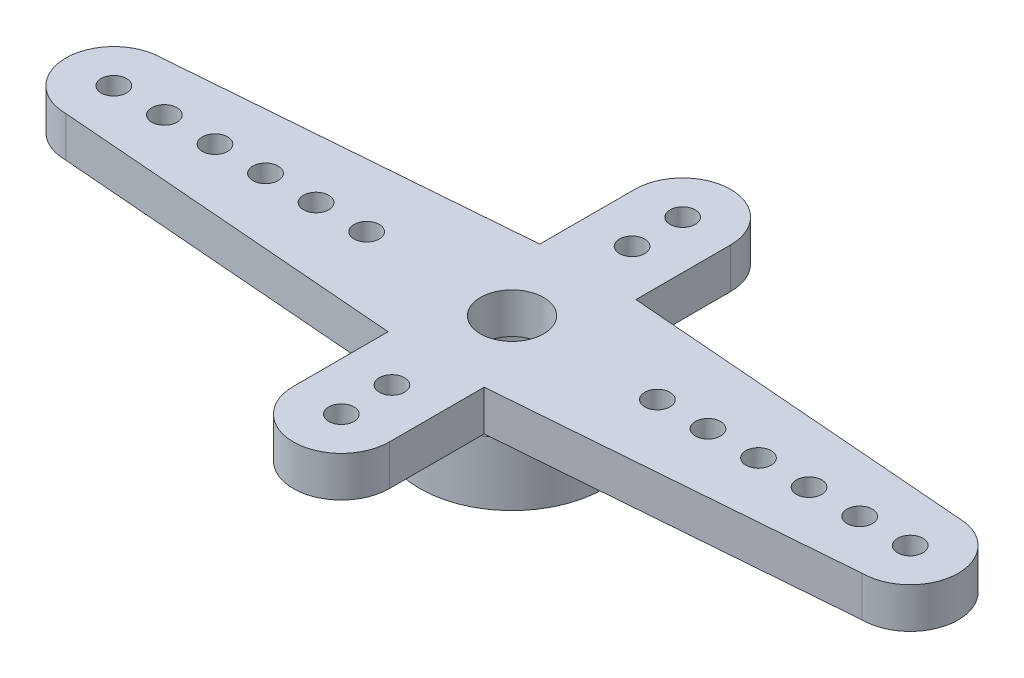
ISO-10303-21;
HEADER;
FILE_DESCRIPTION(('STEP AP214'),'2;1');
FILE_NAME('part.step','',(''),(''),'','','');
FILE_SCHEMA(('AUTOMOTIVE_DESIGN { 1 0 10303 214 1 1 1 1 }'));
ENDSEC;
DATA;
#1=APPLICATION_CONTEXT('core data for automotive mechanical design processes');
#2=APPLICATION_PROTOCOL_DEFINITION('international standard','automotive_design',2000,#1);
#3=PRODUCT_CONTEXT('',#1,'mechanical');
#4=PRODUCT('Part','Part','',(#3));
#5=PRODUCT_RELATED_PRODUCT_CATEGORY('part','',(#4));
#6=PRODUCT_DEFINITION_FORMATION('','',#4);
#7=PRODUCT_DEFINITION_CONTEXT('part definition',#1,'design');
#8=PRODUCT_DEFINITION('design','',#6,#7);
#9=PRODUCT_DEFINITION_SHAPE('','',#8);
#10=(LENGTH_UNIT() NAMED_UNIT(*) SI_UNIT(.MILLI.,.METRE.));
#11=(NAMED_UNIT(*) PLANE_ANGLE_UNIT() SI_UNIT($,.RADIAN.));
#12=(NAMED_UNIT(*) SI_UNIT($,.STERADIAN.) SOLID_ANGLE_UNIT());
#13=UNCERTAINTY_MEASURE_WITH_UNIT(LENGTH_MEASURE(1.E-05),#10,'distance_accuracy_value','');
#14=(GEOMETRIC_REPRESENTATION_CONTEXT(3) GLOBAL_UNCERTAINTY_ASSIGNED_CONTEXT((#13)) GLOBAL_UNIT_ASSIGNED_CONTEXT((#10,
#11,#12)) REPRESENTATION_CONTEXT('',''));
#15=CARTESIAN_POINT('',(0.,0.,0.));
#16=DIRECTION('',(0.,0.,1.));
#17=DIRECTION('',(1.,0.,0.));
#18=AXIS2_PLACEMENT_3D('',#15,#16,#17);
#19=CARTESIAN_POINT('',(0.,2.5,0.));
#20=DIRECTION('',(0.,1.,0.));
#21=DIRECTION('',(0.,0.,1.));
#22=AXIS2_PLACEMENT_3D('',#19,#20,#21);
#23=PLANE('',#22);
#24=DIRECTION('',(0.,0.,-1.));
#25=VECTOR('',#24,1.);
#26=CARTESIAN_POINT('',(1.9,2.5,-6.75));
#27=LINE('',#26,#25);
#28=CARTESIAN_POINT('',(1.9,2.5,-3.));
#29=VERTEX_POINT('',#28);
#30=CARTESIAN_POINT('',(1.9,2.5,-3.11648840844948));
#31=VERTEX_POINT('',#30);
#32=EDGE_CURVE('E51',#29,#31,#27,.T.);
#33=ORIENTED_EDGE('',*,*,#32,.F.);
#34=DIRECTION('',(-0.996860885732547,0.,-0.0791730667368807));
#35=VECTOR('',#34,1.);
#36=CARTESIAN_POINT('',(15.75,2.5,-1.9));
#37=LINE('',#36,#35);
#38=CARTESIAN_POINT('',(2.10202641784576,2.5,-2.9839545805321));
#39=VERTEX_POINT('',#38);
#40=EDGE_CURVE('E11',#39,#29,#37,.T.);
#41=ORIENTED_EDGE('',*,*,#40,.F.);
#42=CARTESIAN_POINT('',(0.,2.5,0.));
#43=DIRECTION('',(0.,1.,0.));
#44=DIRECTION('',(0.,0.,1.));
#45=AXIS2_PLACEMENT_3D('',#42,#43,#44);
#46=CIRCLE('',#45,3.65);
#47=EDGE_CURVE('E197',#39,#31,#46,.T.);
#48=ORIENTED_EDGE('',*,*,#47,.T.);
#49=EDGE_LOOP('',(#33,#41,#48));
#50=FACE_BOUND('',#49,.T.);
#51=ADVANCED_FACE('F33',(#50),#23,.T.);
#52=DIRECTION('',(0.996860885732547,0.,-0.0791730667368813));
#53=VECTOR('',#52,1.);
#54=CARTESIAN_POINT('',(15.75,2.5,1.9));
#55=LINE('',#54,#53);
#56=CARTESIAN_POINT('',(1.9,2.5,3.00000000000001));
#57=VERTEX_POINT('',#56);
#58=CARTESIAN_POINT('',(2.10202641784575,2.5,2.98395458053211));
#59=VERTEX_POINT('',#58);
#60=EDGE_CURVE('E58',#57,#59,#55,.T.);
#61=ORIENTED_EDGE('',*,*,#60,.F.);
#62=DIRECTION('',(0.,0.,-1.));
#63=VECTOR('',#62,1.);
#64=CARTESIAN_POINT('',(1.9,2.5,6.75000000000001));
#65=LINE('',#64,#63);
#66=CARTESIAN_POINT('',(1.9,2.5,3.11648840844948));
#67=VERTEX_POINT('',#66);
#68=EDGE_CURVE('E42',#67,#57,#65,.T.);
#69=ORIENTED_EDGE('',*,*,#68,.F.);
#70=EDGE_CURVE('E187',#67,#59,#46,.T.);
#71=ORIENTED_EDGE('',*,*,#70,.T.);
#72=EDGE_LOOP('',(#61,#69,#71));
#73=FACE_BOUND('',#72,.T.);
#74=ADVANCED_FACE('F233',(#73),#23,.T.);
#75=DIRECTION('',(0.,0.,1.));
#76=VECTOR('',#75,1.);
#77=CARTESIAN_POINT('',(-1.9,2.5,6.75000000000001));
#78=LINE('',#77,#76);
#79=CARTESIAN_POINT('',(-1.9,2.5,3.00000000000001));
#80=VERTEX_POINT('',#79);
#81=CARTESIAN_POINT('',(-1.9,2.5,3.11648840844949));
#82=VERTEX_POINT('',#81);
#83=EDGE_CURVE('E285',#80,#82,#78,.T.);
#84=ORIENTED_EDGE('',*,*,#83,.F.);
#85=DIRECTION('',(0.996860885732547,0.,0.0791730667368811));
#86=VECTOR('',#85,1.);
#87=CARTESIAN_POINT('',(-15.75,2.5,1.9));
#88=LINE('',#87,#86);
#89=CARTESIAN_POINT('',(-2.10202641784575,2.5,2.98395458053211));
#90=VERTEX_POINT('',#89);
#91=EDGE_CURVE('E193',#90,#80,#88,.T.);
#92=ORIENTED_EDGE('',*,*,#91,.F.);
#93=EDGE_CURVE('E199',#90,#82,#46,.T.);
#94=ORIENTED_EDGE('',*,*,#93,.T.);
#95=EDGE_LOOP('',(#84,#92,#94));
#96=FACE_BOUND('',#95,.T.);
#97=ADVANCED_FACE('F237',(#96),#23,.T.);
#98=DIRECTION('',(-0.996860885732547,0.,0.079173066736881));
#99=VECTOR('',#98,1.);
#100=CARTESIAN_POINT('',(-15.75,2.5,-1.9));
#101=LINE('',#100,#99);
#102=CARTESIAN_POINT('',(-1.9,2.5,-3.));
#103=VERTEX_POINT('',#102);
#104=CARTESIAN_POINT('',(-2.10202641784576,2.5,-2.9839545805321));
#105=VERTEX_POINT('',#104);
#106=EDGE_CURVE('E246',#103,#105,#101,.T.);
#107=ORIENTED_EDGE('',*,*,#106,.F.);
#108=DIRECTION('',(0.,0.,1.));
#109=VECTOR('',#108,1.);
#110=CARTESIAN_POINT('',(-1.9,2.5,-6.75));
#111=LINE('',#110,#109);
#112=CARTESIAN_POINT('',(-1.9,2.5,-3.11648840844949));
#113=VERTEX_POINT('',#112);
#114=EDGE_CURVE('E188',#113,#103,#111,.T.);
#115=ORIENTED_EDGE('',*,*,#114,.F.);
#116=EDGE_CURVE('E248',#113,#105,#46,.T.);
#117=ORIENTED_EDGE('',*,*,#116,.T.);
#118=EDGE_LOOP('',(#107,#115,#117));
#119=FACE_BOUND('',#118,.T.);
#120=ADVANCED_FACE('F213',(#119),#23,.T.);
#121=CARTESIAN_POINT('',(0.,0.,0.));
#122=DIRECTION('',(0.,1.,0.));
#123=DIRECTION('',(0.,0.,1.));
#124=AXIS2_PLACEMENT_3D('',#121,#122,#123);
#125=PLANE('',#124);
#126=CARTESIAN_POINT('',(0.,0.,0.));
#127=DIRECTION('',(0.,1.,0.));
#128=DIRECTION('',(0.,0.,1.));
#129=AXIS2_PLACEMENT_3D('',#126,#127,#128);
#130=CIRCLE('',#129,3.65);
#131=CARTESIAN_POINT('',(0.,0.,3.65));
#132=VERTEX_POINT('',#131);
#133=EDGE_CURVE('E37',#132,#132,#130,.T.);
#134=ORIENTED_EDGE('',*,*,#133,.F.);
#135=EDGE_LOOP('',(#134));
#136=FACE_BOUND('',#135,.T.);
#137=CARTESIAN_POINT('',(0.,0.,0.));
#138=DIRECTION('',(0.,1.,0.));
#139=DIRECTION('',(0.,0.,1.));
#140=AXIS2_PLACEMENT_3D('',#137,#138,#139);
#141=CIRCLE('',#140,2.5);
#142=CARTESIAN_POINT('',(0.,0.,2.5));
#143=VERTEX_POINT('',#142);
#144=EDGE_CURVE('E180',#143,#143,#141,.T.);
#145=ORIENTED_EDGE('',*,*,#144,.T.);
#146=EDGE_LOOP('',(#145));
#147=FACE_BOUND('',#146,.T.);
#148=ADVANCED_FACE('F210',(#136,#147),#125,.F.);
#149=CARTESIAN_POINT('',(0.,2.5,0.));
#150=DIRECTION('',(0.,-1.,0.));
#151=DIRECTION('',(0.,0.,-1.));
#152=AXIS2_PLACEMENT_3D('',#149,#150,#151);
#153=CYLINDRICAL_SURFACE('',#152,3.65);
#154=ORIENTED_EDGE('',*,*,#70,.F.);
#155=EDGE_CURVE('E190',#82,#67,#46,.T.);
#156=ORIENTED_EDGE('',*,*,#155,.F.);
#157=ORIENTED_EDGE('',*,*,#93,.F.);
#158=EDGE_CURVE('E205',#105,#90,#46,.T.);
#159=ORIENTED_EDGE('',*,*,#158,.F.);
#160=ORIENTED_EDGE('',*,*,#116,.F.);
#161=EDGE_CURVE('E368',#31,#113,#46,.T.);
#162=ORIENTED_EDGE('',*,*,#161,.F.);
#163=ORIENTED_EDGE('',*,*,#47,.F.);
#164=EDGE_CURVE('E189',#59,#39,#46,.T.);
#165=ORIENTED_EDGE('',*,*,#164,.F.);
#166=EDGE_LOOP('',(#154,#156,#157,#159,#160,#162,#163,#165));
#167=FACE_BOUND('',#166,.T.);
#168=ORIENTED_EDGE('',*,*,#133,.T.);
#169=EDGE_LOOP('',(#168));
#170=FACE_BOUND('',#169,.T.);
#171=ADVANCED_FACE('F35',(#167,#170),#153,.T.);
#172=CARTESIAN_POINT('',(0.,2.5,0.));
#173=DIRECTION('',(0.,-1.,0.));
#174=DIRECTION('',(0.,0.,-1.));
#175=AXIS2_PLACEMENT_3D('',#172,#173,#174);
#176=CYLINDRICAL_SURFACE('',#175,2.5);
#177=CARTESIAN_POINT('',(0.,2.5,0.));
#178=DIRECTION('',(0.,1.,0.));
#179=DIRECTION('',(0.,0.,1.));
#180=AXIS2_PLACEMENT_3D('',#177,#178,#179);
#181=CIRCLE('',#180,2.5);
#182=CARTESIAN_POINT('',(0.,2.5,2.5));
#183=VERTEX_POINT('',#182);
#184=EDGE_CURVE('E177',#183,#183,#181,.T.);
#185=ORIENTED_EDGE('',*,*,#184,.T.);
#186=EDGE_LOOP('',(#185));
#187=FACE_BOUND('',#186,.T.);
#188=ORIENTED_EDGE('',*,*,#144,.F.);
#189=EDGE_LOOP('',(#188));
#190=FACE_BOUND('',#189,.T.);
#191=ADVANCED_FACE('F216',(#187,#190),#176,.F.);
#192=CARTESIAN_POINT('',(0.,2.5,-6.75));
#193=DIRECTION('',(0.,-1.,0.));
#194=DIRECTION('',(0.,0.,-1.));
#195=AXIS2_PLACEMENT_3D('',#192,#193,#194);
#196=PLANE('',#195);
#197=CARTESIAN_POINT('',(7.75,2.5,0.));
#198=DIRECTION('',(0.,-1.,0.));
#199=DIRECTION('',(0.,0.,-1.));
#200=AXIS2_PLACEMENT_3D('',#197,#198,#199);
#201=CIRCLE('',#200,0.5);
#202=CARTESIAN_POINT('',(7.75,2.5,-0.500000000000052));
#203=VERTEX_POINT('',#202);
#204=EDGE_CURVE('E472',#203,#203,#201,.F.);
#205=ORIENTED_EDGE('',*,*,#204,.T.);
#206=EDGE_LOOP('',(#205));
#207=FACE_BOUND('',#206,.T.);
#208=CARTESIAN_POINT('',(9.75,2.5,0.));
#209=DIRECTION('',(0.,-1.,0.));
#210=DIRECTION('',(0.,0.,-1.));
#211=AXIS2_PLACEMENT_3D('',#208,#209,#210);
#212=CIRCLE('',#211,0.500000000000003);
#213=CARTESIAN_POINT('',(9.75,2.5,-0.500000000000069));
#214=VERTEX_POINT('',#213);
#215=EDGE_CURVE('E466',#214,#214,#212,.F.);
#216=ORIENTED_EDGE('',*,*,#215,.T.);
#217=EDGE_LOOP('',(#216));
#218=FACE_BOUND('',#217,.T.);
#219=CARTESIAN_POINT('',(11.75,2.5,0.));
#220=DIRECTION('',(0.,-1.,0.));
#221=DIRECTION('',(0.,0.,-1.));
#222=AXIS2_PLACEMENT_3D('',#219,#220,#221);
#223=CIRCLE('',#222,0.500000000000003);
#224=CARTESIAN_POINT('',(11.75,2.5,-0.500000000000083));
#225=VERTEX_POINT('',#224);
#226=EDGE_CURVE('E460',#225,#225,#223,.F.);
#227=ORIENTED_EDGE('',*,*,#226,.T.);
#228=EDGE_LOOP('',(#227));
#229=FACE_BOUND('',#228,.T.);
#230=CARTESIAN_POINT('',(13.75,2.5,0.));
#231=DIRECTION('',(0.,-1.,0.));
#232=DIRECTION('',(0.,0.,-1.));
#233=AXIS2_PLACEMENT_3D('',#230,#231,#232);
#234=CIRCLE('',#233,0.500000000000003);
#235=CARTESIAN_POINT('',(13.75,2.5,-0.500000000000097));
#236=VERTEX_POINT('',#235);
#237=EDGE_CURVE('E453',#236,#236,#234,.F.);
#238=ORIENTED_EDGE('',*,*,#237,.T.);
#239=EDGE_LOOP('',(#238));
#240=FACE_BOUND('',#239,.T.);
#241=CARTESIAN_POINT('',(15.75,2.5,-1.07769695945059E-13));
#242=DIRECTION('',(0.,-1.,0.));
#243=DIRECTION('',(0.,0.,-1.));
#244=AXIS2_PLACEMENT_3D('',#241,#242,#243);
#245=CIRCLE('',#244,0.500000000000003);
#246=CARTESIAN_POINT('',(15.75,2.5,-0.500000000000111));
#247=VERTEX_POINT('',#246);
#248=EDGE_CURVE('E488',#247,#247,#245,.F.);
#249=ORIENTED_EDGE('',*,*,#248,.T.);
#250=EDGE_LOOP('',(#249));
#251=FACE_BOUND('',#250,.T.);
#252=CARTESIAN_POINT('',(5.75,2.5,0.));
#253=DIRECTION('',(0.,-1.,0.));
#254=DIRECTION('',(0.,0.,-1.));
#255=AXIS2_PLACEMENT_3D('',#252,#253,#254);
#256=CIRCLE('',#255,0.5);
#257=CARTESIAN_POINT('',(5.75,2.5,-0.500000000000038));
#258=VERTEX_POINT('',#257);
#259=EDGE_CURVE('E429',#258,#258,#256,.F.);
#260=ORIENTED_EDGE('',*,*,#259,.T.);
#261=EDGE_LOOP('',(#260));
#262=FACE_BOUND('',#261,.T.);
#263=CARTESIAN_POINT('',(15.75,2.5,1.9));
#264=VERTEX_POINT('',#263);
#265=EDGE_CURVE('E292',#59,#264,#55,.T.);
#266=ORIENTED_EDGE('',*,*,#265,.F.);
#267=ORIENTED_EDGE('',*,*,#164,.T.);
#268=CARTESIAN_POINT('',(15.75,2.5,-1.9));
#269=VERTEX_POINT('',#268);
#270=EDGE_CURVE('E44',#269,#39,#37,.T.);
#271=ORIENTED_EDGE('',*,*,#270,.F.);
#272=CARTESIAN_POINT('',(15.75,2.5,0.));
#273=DIRECTION('',(0.,1.,0.));
#274=DIRECTION('',(0.,0.,-1.));
#275=AXIS2_PLACEMENT_3D('',#272,#273,#274);
#276=CIRCLE('',#275,1.9);
#277=EDGE_CURVE('E294',#264,#269,#276,.T.);
#278=ORIENTED_EDGE('',*,*,#277,.F.);
#279=EDGE_LOOP('',(#266,#267,#271,#278));
#280=FACE_BOUND('',#279,.T.);
#281=ADVANCED_FACE('F218',(#207,#218,#229,#240,#251,#262,#280),#196,.T.);
#282=CARTESIAN_POINT('',(0.,2.5,-6.75));
#283=DIRECTION('',(0.,-1.,0.));
#284=DIRECTION('',(0.,0.,-1.));
#285=AXIS2_PLACEMENT_3D('',#282,#283,#284);
#286=CIRCLE('',#285,0.5);
#287=CARTESIAN_POINT('',(0.,2.5,-7.25));
#288=VERTEX_POINT('',#287);
#289=EDGE_CURVE('E401',#288,#288,#286,.F.);
#290=ORIENTED_EDGE('',*,*,#289,.T.);
#291=EDGE_LOOP('',(#290));
#292=FACE_BOUND('',#291,.T.);
#293=CARTESIAN_POINT('',(0.,2.5,-4.75));
#294=DIRECTION('',(0.,-1.,0.));
#295=DIRECTION('',(0.,0.,-1.));
#296=AXIS2_PLACEMENT_3D('',#293,#294,#295);
#297=CIRCLE('',#296,0.5);
#298=CARTESIAN_POINT('',(0.,2.5,-5.25));
#299=VERTEX_POINT('',#298);
#300=EDGE_CURVE('E411',#299,#299,#297,.F.);
#301=ORIENTED_EDGE('',*,*,#300,.T.);
#302=EDGE_LOOP('',(#301));
#303=FACE_BOUND('',#302,.T.);
#304=CARTESIAN_POINT('',(1.9,2.5,-6.75));
#305=VERTEX_POINT('',#304);
#306=EDGE_CURVE('E297',#31,#305,#27,.T.);
#307=ORIENTED_EDGE('',*,*,#306,.F.);
#308=ORIENTED_EDGE('',*,*,#161,.T.);
#309=CARTESIAN_POINT('',(-1.9,2.5,-6.75));
#310=VERTEX_POINT('',#309);
#311=EDGE_CURVE('E195',#310,#113,#111,.T.);
#312=ORIENTED_EDGE('',*,*,#311,.F.);
#313=CARTESIAN_POINT('',(0.,2.5,-6.75));
#314=DIRECTION('',(0.,1.,0.));
#315=DIRECTION('',(0.,0.,-1.));
#316=AXIS2_PLACEMENT_3D('',#313,#314,#315);
#317=CIRCLE('',#316,1.9);
#318=EDGE_CURVE('E176',#305,#310,#317,.T.);
#319=ORIENTED_EDGE('',*,*,#318,.F.);
#320=EDGE_LOOP('',(#307,#308,#312,#319));
#321=FACE_BOUND('',#320,.T.);
#322=ADVANCED_FACE('F225',(#292,#303,#321),#196,.T.);
#323=CARTESIAN_POINT('',(-11.75,2.5,0.));
#324=DIRECTION('',(0.,-1.,0.));
#325=DIRECTION('',(0.,0.,-1.));
#326=AXIS2_PLACEMENT_3D('',#323,#324,#325);
#327=CIRCLE('',#326,0.500000000000001);
#328=CARTESIAN_POINT('',(-11.75,2.5,-0.499999999999998));
#329=VERTEX_POINT('',#328);
#330=EDGE_CURVE('E417',#329,#329,#327,.F.);
#331=ORIENTED_EDGE('',*,*,#330,.T.);
#332=EDGE_LOOP('',(#331));
#333=FACE_BOUND('',#332,.T.);
#334=CARTESIAN_POINT('',(-13.75,2.5,0.));
#335=DIRECTION('',(0.,-1.,0.));
#336=DIRECTION('',(0.,0.,-1.));
#337=AXIS2_PLACEMENT_3D('',#334,#335,#336);
#338=CIRCLE('',#337,0.500000000000001);
#339=CARTESIAN_POINT('',(-13.75,2.5,-0.499999999999998));
#340=VERTEX_POINT('',#339);
#341=EDGE_CURVE('E424',#340,#340,#338,.F.);
#342=ORIENTED_EDGE('',*,*,#341,.T.);
#343=EDGE_LOOP('',(#342));
#344=FACE_BOUND('',#343,.T.);
#345=CARTESIAN_POINT('',(-15.75,2.5,0.));
#346=DIRECTION('',(0.,-1.,0.));
#347=DIRECTION('',(0.,0.,-1.));
#348=AXIS2_PLACEMENT_3D('',#345,#346,#347);
#349=CIRCLE('',#348,0.500000000000001);
#350=CARTESIAN_POINT('',(-15.75,2.5,-0.499999999999998));
#351=VERTEX_POINT('',#350);
#352=EDGE_CURVE('E404',#351,#351,#349,.F.);
#353=ORIENTED_EDGE('',*,*,#352,.T.);
#354=EDGE_LOOP('',(#353));
#355=FACE_BOUND('',#354,.T.);
#356=CARTESIAN_POINT('',(-9.75,2.5,0.));
#357=DIRECTION('',(0.,-1.,0.));
#358=DIRECTION('',(0.,0.,-1.));
#359=AXIS2_PLACEMENT_3D('',#356,#357,#358);
#360=CIRCLE('',#359,0.500000000000001);
#361=CARTESIAN_POINT('',(-9.75,2.5,-0.499999999999998));
#362=VERTEX_POINT('',#361);
#363=EDGE_CURVE('E448',#362,#362,#360,.F.);
#364=ORIENTED_EDGE('',*,*,#363,.T.);
#365=EDGE_LOOP('',(#364));
#366=FACE_BOUND('',#365,.T.);
#367=CARTESIAN_POINT('',(-7.75,2.5,0.));
#368=DIRECTION('',(0.,-1.,0.));
#369=DIRECTION('',(0.,0.,-1.));
#370=AXIS2_PLACEMENT_3D('',#367,#368,#369);
#371=CIRCLE('',#370,0.500000000000001);
#372=CARTESIAN_POINT('',(-7.75,2.5,-0.499999999999998));
#373=VERTEX_POINT('',#372);
#374=EDGE_CURVE('E442',#373,#373,#371,.F.);
#375=ORIENTED_EDGE('',*,*,#374,.T.);
#376=EDGE_LOOP('',(#375));
#377=FACE_BOUND('',#376,.T.);
#378=CARTESIAN_POINT('',(-5.75,2.5,0.));
#379=DIRECTION('',(0.,-1.,0.));
#380=DIRECTION('',(0.,0.,-1.));
#381=AXIS2_PLACEMENT_3D('',#378,#379,#380);
#382=CIRCLE('',#381,0.500000000000001);
#383=CARTESIAN_POINT('',(-5.75,2.5,-0.499999999999998));
#384=VERTEX_POINT('',#383);
#385=EDGE_CURVE('E436',#384,#384,#382,.F.);
#386=ORIENTED_EDGE('',*,*,#385,.T.);
#387=EDGE_LOOP('',(#386));
#388=FACE_BOUND('',#387,.T.);
#389=CARTESIAN_POINT('',(-15.75,2.5,-1.9));
#390=VERTEX_POINT('',#389);
#391=EDGE_CURVE('E252',#105,#390,#101,.T.);
#392=ORIENTED_EDGE('',*,*,#391,.F.);
#393=ORIENTED_EDGE('',*,*,#158,.T.);
#394=CARTESIAN_POINT('',(-15.75,2.5,1.9));
#395=VERTEX_POINT('',#394);
#396=EDGE_CURVE('E281',#395,#90,#88,.T.);
#397=ORIENTED_EDGE('',*,*,#396,.F.);
#398=CARTESIAN_POINT('',(-15.75,2.5,0.));
#399=DIRECTION('',(0.,1.,0.));
#400=DIRECTION('',(0.,0.,1.));
#401=AXIS2_PLACEMENT_3D('',#398,#399,#400);
#402=CIRCLE('',#401,1.9);
#403=EDGE_CURVE('E251',#390,#395,#402,.T.);
#404=ORIENTED_EDGE('',*,*,#403,.F.);
#405=EDGE_LOOP('',(#392,#393,#397,#404));
#406=FACE_BOUND('',#405,.T.);
#407=ADVANCED_FACE('F329',(#333,#344,#355,#366,#377,#388,#406),#196,.T.);
#408=CARTESIAN_POINT('',(0.,2.5,0.));
#409=DIRECTION('',(0.,1.,0.));
#410=DIRECTION('',(0.,0.,1.));
#411=AXIS2_PLACEMENT_3D('',#408,#409,#410);
#412=CIRCLE('',#411,1.25);
#413=CARTESIAN_POINT('',(0.,2.5,1.25));
#414=VERTEX_POINT('',#413);
#415=EDGE_CURVE('E393',#414,#414,#412,.T.);
#416=ORIENTED_EDGE('',*,*,#415,.T.);
#417=EDGE_LOOP('',(#416));
#418=FACE_BOUND('',#417,.T.);
#419=ORIENTED_EDGE('',*,*,#184,.F.);
#420=EDGE_LOOP('',(#419));
#421=FACE_BOUND('',#420,.T.);
#422=ADVANCED_FACE('F374',(#418,#421),#196,.T.);
#423=CARTESIAN_POINT('',(0.,4.1,-6.75));
#424=DIRECTION('',(0.,-1.,0.));
#425=DIRECTION('',(0.,0.,-1.));
#426=AXIS2_PLACEMENT_3D('',#423,#424,#425);
#427=PLANE('',#426);
#428=CARTESIAN_POINT('',(0.,4.1,-6.75));
#429=DIRECTION('',(0.,1.,0.));
#430=DIRECTION('',(0.,0.,1.));
#431=AXIS2_PLACEMENT_3D('',#428,#429,#430);
#432=CIRCLE('',#431,0.5);
#433=CARTESIAN_POINT('',(0.,4.1,-6.25));
#434=VERTEX_POINT('',#433);
#435=EDGE_CURVE('E396',#434,#434,#432,.T.);
#436=ORIENTED_EDGE('',*,*,#435,.F.);
#437=EDGE_LOOP('',(#436));
#438=FACE_BOUND('',#437,.T.);
#439=CARTESIAN_POINT('',(7.75,4.1,0.));
#440=DIRECTION('',(0.,1.,0.));
#441=DIRECTION('',(0.,0.,-1.));
#442=AXIS2_PLACEMENT_3D('',#439,#440,#441);
#443=CIRCLE('',#442,0.5);
#444=CARTESIAN_POINT('',(7.75,4.1,-0.500000000000052));
#445=VERTEX_POINT('',#444);
#446=EDGE_CURVE('E433',#445,#445,#443,.T.);
#447=ORIENTED_EDGE('',*,*,#446,.F.);
#448=EDGE_LOOP('',(#447));
#449=FACE_BOUND('',#448,.T.);
#450=CARTESIAN_POINT('',(9.75,4.1,0.));
#451=DIRECTION('',(0.,1.,0.));
#452=DIRECTION('',(0.,0.,-1.));
#453=AXIS2_PLACEMENT_3D('',#450,#451,#452);
#454=CIRCLE('',#453,0.500000000000003);
#455=CARTESIAN_POINT('',(9.75,4.1,-0.500000000000069));
#456=VERTEX_POINT('',#455);
#457=EDGE_CURVE('E469',#456,#456,#454,.T.);
#458=ORIENTED_EDGE('',*,*,#457,.F.);
#459=EDGE_LOOP('',(#458));
#460=FACE_BOUND('',#459,.T.);
#461=CARTESIAN_POINT('',(11.75,4.1,0.));
#462=DIRECTION('',(0.,1.,0.));
#463=DIRECTION('',(0.,0.,-1.));
#464=AXIS2_PLACEMENT_3D('',#461,#462,#463);
#465=CIRCLE('',#464,0.500000000000003);
#466=CARTESIAN_POINT('',(11.75,4.1,-0.500000000000083));
#467=VERTEX_POINT('',#466);
#468=EDGE_CURVE('E463',#467,#467,#465,.T.);
#469=ORIENTED_EDGE('',*,*,#468,.F.);
#470=EDGE_LOOP('',(#469));
#471=FACE_BOUND('',#470,.T.);
#472=CARTESIAN_POINT('',(13.75,4.1,0.));
#473=DIRECTION('',(0.,1.,0.));
#474=DIRECTION('',(0.,0.,-1.));
#475=AXIS2_PLACEMENT_3D('',#472,#473,#474);
#476=CIRCLE('',#475,0.500000000000003);
#477=CARTESIAN_POINT('',(13.75,4.1,-0.500000000000097));
#478=VERTEX_POINT('',#477);
#479=EDGE_CURVE('E456',#478,#478,#476,.T.);
#480=ORIENTED_EDGE('',*,*,#479,.F.);
#481=EDGE_LOOP('',(#480));
#482=FACE_BOUND('',#481,.T.);
#483=CARTESIAN_POINT('',(15.75,4.1,-1.07769695945059E-13));
#484=DIRECTION('',(0.,1.,0.));
#485=DIRECTION('',(0.,0.,-1.));
#486=AXIS2_PLACEMENT_3D('',#483,#484,#485);
#487=CIRCLE('',#486,0.500000000000003);
#488=CARTESIAN_POINT('',(15.75,4.1,-0.500000000000111));
#489=VERTEX_POINT('',#488);
#490=EDGE_CURVE('E457',#489,#489,#487,.T.);
#491=ORIENTED_EDGE('',*,*,#490,.F.);
#492=EDGE_LOOP('',(#491));
#493=FACE_BOUND('',#492,.T.);
#494=CARTESIAN_POINT('',(0.,4.1,4.75));
#495=DIRECTION('',(0.,1.,0.));
#496=DIRECTION('',(0.,0.,-1.));
#497=AXIS2_PLACEMENT_3D('',#494,#495,#496);
#498=CIRCLE('',#497,0.5);
#499=CARTESIAN_POINT('',(0.,4.1,4.25));
#500=VERTEX_POINT('',#499);
#501=EDGE_CURVE('E485',#500,#500,#498,.T.);
#502=ORIENTED_EDGE('',*,*,#501,.F.);
#503=EDGE_LOOP('',(#502));
#504=FACE_BOUND('',#503,.T.);
#505=CARTESIAN_POINT('',(0.,4.1,6.75));
#506=DIRECTION('',(0.,1.,0.));
#507=DIRECTION('',(0.,0.,-1.));
#508=AXIS2_PLACEMENT_3D('',#505,#506,#507);
#509=CIRCLE('',#508,0.5);
#510=CARTESIAN_POINT('',(0.,4.1,6.25));
#511=VERTEX_POINT('',#510);
#512=EDGE_CURVE('E480',#511,#511,#509,.T.);
#513=ORIENTED_EDGE('',*,*,#512,.F.);
#514=EDGE_LOOP('',(#513));
#515=FACE_BOUND('',#514,.T.);
#516=CARTESIAN_POINT('',(-11.75,4.1,0.));
#517=DIRECTION('',(0.,1.,0.));
#518=DIRECTION('',(0.,0.,1.));
#519=AXIS2_PLACEMENT_3D('',#516,#517,#518);
#520=CIRCLE('',#519,0.500000000000001);
#521=CARTESIAN_POINT('',(-11.75,4.1,0.500000000000004));
#522=VERTEX_POINT('',#521);
#523=EDGE_CURVE('E420',#522,#522,#520,.T.);
#524=ORIENTED_EDGE('',*,*,#523,.F.);
#525=EDGE_LOOP('',(#524));
#526=FACE_BOUND('',#525,.T.);
#527=CARTESIAN_POINT('',(-13.75,4.1,0.));
#528=DIRECTION('',(0.,1.,0.));
#529=DIRECTION('',(0.,0.,1.));
#530=AXIS2_PLACEMENT_3D('',#527,#528,#529);
#531=CIRCLE('',#530,0.500000000000001);
#532=CARTESIAN_POINT('',(-13.75,4.1,0.500000000000004));
#533=VERTEX_POINT('',#532);
#534=EDGE_CURVE('E408',#533,#533,#531,.T.);
#535=ORIENTED_EDGE('',*,*,#534,.F.);
#536=EDGE_LOOP('',(#535));
#537=FACE_BOUND('',#536,.T.);
#538=CARTESIAN_POINT('',(-15.75,4.1,0.));
#539=DIRECTION('',(0.,1.,0.));
#540=DIRECTION('',(0.,0.,1.));
#541=AXIS2_PLACEMENT_3D('',#538,#539,#540);
#542=CIRCLE('',#541,0.500000000000001);
#543=CARTESIAN_POINT('',(-15.75,4.1,0.500000000000004));
#544=VERTEX_POINT('',#543);
#545=EDGE_CURVE('E407',#544,#544,#542,.T.);
#546=ORIENTED_EDGE('',*,*,#545,.F.);
#547=EDGE_LOOP('',(#546));
#548=FACE_BOUND('',#547,.T.);
#549=CARTESIAN_POINT('',(0.,4.1,-4.75));
#550=DIRECTION('',(0.,1.,0.));
#551=DIRECTION('',(0.,0.,1.));
#552=AXIS2_PLACEMENT_3D('',#549,#550,#551);
#553=CIRCLE('',#552,0.5);
#554=CARTESIAN_POINT('',(0.,4.1,-4.25));
#555=VERTEX_POINT('',#554);
#556=EDGE_CURVE('E414',#555,#555,#553,.T.);
#557=ORIENTED_EDGE('',*,*,#556,.F.);
#558=EDGE_LOOP('',(#557));
#559=FACE_BOUND('',#558,.T.);
#560=CARTESIAN_POINT('',(-9.75,4.1,0.));
#561=DIRECTION('',(0.,1.,0.));
#562=DIRECTION('',(0.,0.,1.));
#563=AXIS2_PLACEMENT_3D('',#560,#561,#562);
#564=CIRCLE('',#563,0.500000000000001);
#565=CARTESIAN_POINT('',(-9.75,4.1,0.500000000000004));
#566=VERTEX_POINT('',#565);
#567=EDGE_CURVE('E421',#566,#566,#564,.T.);
#568=ORIENTED_EDGE('',*,*,#567,.F.);
#569=EDGE_LOOP('',(#568));
#570=FACE_BOUND('',#569,.T.);
#571=CARTESIAN_POINT('',(-7.75,4.1,0.));
#572=DIRECTION('',(0.,1.,0.));
#573=DIRECTION('',(0.,0.,1.));
#574=AXIS2_PLACEMENT_3D('',#571,#572,#573);
#575=CIRCLE('',#574,0.500000000000001);
#576=CARTESIAN_POINT('',(-7.75,4.1,0.500000000000004));
#577=VERTEX_POINT('',#576);
#578=EDGE_CURVE('E445',#577,#577,#575,.T.);
#579=ORIENTED_EDGE('',*,*,#578,.F.);
#580=EDGE_LOOP('',(#579));
#581=FACE_BOUND('',#580,.T.);
#582=CARTESIAN_POINT('',(-5.75,4.1,0.));
#583=DIRECTION('',(0.,1.,0.));
#584=DIRECTION('',(0.,0.,1.));
#585=AXIS2_PLACEMENT_3D('',#582,#583,#584);
#586=CIRCLE('',#585,0.500000000000001);
#587=CARTESIAN_POINT('',(-5.75,4.1,0.500000000000004));
#588=VERTEX_POINT('',#587);
#589=EDGE_CURVE('E439',#588,#588,#586,.T.);
#590=ORIENTED_EDGE('',*,*,#589,.F.);
#591=EDGE_LOOP('',(#590));
#592=FACE_BOUND('',#591,.T.);
#593=CARTESIAN_POINT('',(5.75,4.1,0.));
#594=DIRECTION('',(0.,1.,0.));
#595=DIRECTION('',(0.,0.,-1.));
#596=AXIS2_PLACEMENT_3D('',#593,#594,#595);
#597=CIRCLE('',#596,0.5);
#598=CARTESIAN_POINT('',(5.75,4.1,-0.500000000000038));
#599=VERTEX_POINT('',#598);
#600=EDGE_CURVE('E432',#599,#599,#597,.T.);
#601=ORIENTED_EDGE('',*,*,#600,.F.);
#602=EDGE_LOOP('',(#601));
#603=FACE_BOUND('',#602,.T.);
#604=CARTESIAN_POINT('',(0.,4.1,-6.75));
#605=DIRECTION('',(0.,1.,0.));
#606=DIRECTION('',(0.,0.,-1.));
#607=AXIS2_PLACEMENT_3D('',#604,#605,#606);
#608=CIRCLE('',#607,1.9);
#609=CARTESIAN_POINT('',(1.9,4.1,-6.75));
#610=VERTEX_POINT('',#609);
#611=CARTESIAN_POINT('',(-1.9,4.1,-6.75));
#612=VERTEX_POINT('',#611);
#613=EDGE_CURVE('E163',#610,#612,#608,.T.);
#614=ORIENTED_EDGE('',*,*,#613,.T.);
#615=DIRECTION('',(0.,0.,1.));
#616=VECTOR('',#615,1.);
#617=CARTESIAN_POINT('',(-1.9,4.1,-6.75));
#618=LINE('',#617,#616);
#619=CARTESIAN_POINT('',(-1.9,4.1,-3.));
#620=VERTEX_POINT('',#619);
#621=EDGE_CURVE('E150',#612,#620,#618,.T.);
#622=ORIENTED_EDGE('',*,*,#621,.T.);
#623=DIRECTION('',(-0.996860885732547,0.,0.079173066736881));
#624=VECTOR('',#623,1.);
#625=CARTESIAN_POINT('',(-15.75,4.1,-1.9));
#626=LINE('',#625,#624);
#627=CARTESIAN_POINT('',(-15.75,4.1,-1.9));
#628=VERTEX_POINT('',#627);
#629=EDGE_CURVE('E162',#620,#628,#626,.T.);
#630=ORIENTED_EDGE('',*,*,#629,.T.);
#631=CARTESIAN_POINT('',(-15.75,4.1,0.));
#632=DIRECTION('',(0.,1.,0.));
#633=DIRECTION('',(0.,0.,1.));
#634=AXIS2_PLACEMENT_3D('',#631,#632,#633);
#635=CIRCLE('',#634,1.9);
#636=CARTESIAN_POINT('',(-15.75,4.1,1.9));
#637=VERTEX_POINT('',#636);
#638=EDGE_CURVE('E258',#628,#637,#635,.T.);
#639=ORIENTED_EDGE('',*,*,#638,.T.);
#640=DIRECTION('',(0.996860885732547,0.,0.0791730667368811));
#641=VECTOR('',#640,1.);
#642=CARTESIAN_POINT('',(-15.75,4.1,1.9));
#643=LINE('',#642,#641);
#644=CARTESIAN_POINT('',(-1.9,4.1,3.00000000000001));
#645=VERTEX_POINT('',#644);
#646=EDGE_CURVE('E260',#637,#645,#643,.T.);
#647=ORIENTED_EDGE('',*,*,#646,.T.);
#648=DIRECTION('',(0.,0.,1.));
#649=VECTOR('',#648,1.);
#650=CARTESIAN_POINT('',(-1.9,4.1,6.75000000000001));
#651=LINE('',#650,#649);
#652=CARTESIAN_POINT('',(-1.9,4.1,6.75000000000001));
#653=VERTEX_POINT('',#652);
#654=EDGE_CURVE('E264',#645,#653,#651,.T.);
#655=ORIENTED_EDGE('',*,*,#654,.T.);
#656=CARTESIAN_POINT('',(0.,4.1,6.75));
#657=DIRECTION('',(0.,1.,0.));
#658=DIRECTION('',(0.,0.,1.));
#659=AXIS2_PLACEMENT_3D('',#656,#657,#658);
#660=CIRCLE('',#659,1.9);
#661=CARTESIAN_POINT('',(1.9,4.1,6.75000000000001));
#662=VERTEX_POINT('',#661);
#663=EDGE_CURVE('E266',#653,#662,#660,.T.);
#664=ORIENTED_EDGE('',*,*,#663,.T.);
#665=DIRECTION('',(0.,0.,-1.));
#666=VECTOR('',#665,1.);
#667=CARTESIAN_POINT('',(1.9,4.1,6.75000000000001));
#668=LINE('',#667,#666);
#669=CARTESIAN_POINT('',(1.9,4.1,3.00000000000001));
#670=VERTEX_POINT('',#669);
#671=EDGE_CURVE('E268',#662,#670,#668,.T.);
#672=ORIENTED_EDGE('',*,*,#671,.T.);
#673=DIRECTION('',(0.996860885732547,0.,-0.0791730667368813));
#674=VECTOR('',#673,1.);
#675=CARTESIAN_POINT('',(15.75,4.1,1.9));
#676=LINE('',#675,#674);
#677=CARTESIAN_POINT('',(15.75,4.1,1.9));
#678=VERTEX_POINT('',#677);
#679=EDGE_CURVE('E270',#670,#678,#676,.T.);
#680=ORIENTED_EDGE('',*,*,#679,.T.);
#681=CARTESIAN_POINT('',(15.75,4.1,0.));
#682=DIRECTION('',(0.,1.,0.));
#683=DIRECTION('',(0.,0.,-1.));
#684=AXIS2_PLACEMENT_3D('',#681,#682,#683);
#685=CIRCLE('',#684,1.9);
#686=CARTESIAN_POINT('',(15.75,4.1,-1.9));
#687=VERTEX_POINT('',#686);
#688=EDGE_CURVE('E272',#678,#687,#685,.T.);
#689=ORIENTED_EDGE('',*,*,#688,.T.);
#690=DIRECTION('',(-0.996860885732547,0.,-0.0791730667368807));
#691=VECTOR('',#690,1.);
#692=CARTESIAN_POINT('',(15.75,4.1,-1.9));
#693=LINE('',#692,#691);
#694=CARTESIAN_POINT('',(1.9,4.1,-3.));
#695=VERTEX_POINT('',#694);
#696=EDGE_CURVE('E274',#687,#695,#693,.T.);
#697=ORIENTED_EDGE('',*,*,#696,.T.);
#698=DIRECTION('',(0.,0.,-1.));
#699=VECTOR('',#698,1.);
#700=CARTESIAN_POINT('',(1.9,4.1,-6.75));
#701=LINE('',#700,#699);
#702=EDGE_CURVE('E169',#695,#610,#701,.T.);
#703=ORIENTED_EDGE('',*,*,#702,.T.);
#704=EDGE_LOOP('',(#614,#622,#630,#639,#647,#655,#664,#672,#680,#689,#697,#703));
#705=FACE_BOUND('',#704,.T.);
#706=CARTESIAN_POINT('',(0.,4.1,0.));
#707=DIRECTION('',(0.,1.,0.));
#708=DIRECTION('',(0.,0.,1.));
#709=AXIS2_PLACEMENT_3D('',#706,#707,#708);
#710=CIRCLE('',#709,1.25);
#711=CARTESIAN_POINT('',(0.,4.1,1.25));
#712=VERTEX_POINT('',#711);
#713=EDGE_CURVE('E278',#712,#712,#710,.T.);
#714=ORIENTED_EDGE('',*,*,#713,.F.);
#715=EDGE_LOOP('',(#714));
#716=FACE_BOUND('',#715,.T.);
#717=ADVANCED_FACE('F166',(#438,#449,#460,#471,#482,#493,#504,#515,#526,#537,#548,#559,#570,
#581,#592,#603,#705,#716),#427,.F.);
#718=CARTESIAN_POINT('',(0.,2.5,4.75));
#719=DIRECTION('',(0.,-1.,0.));
#720=DIRECTION('',(0.,0.,-1.));
#721=AXIS2_PLACEMENT_3D('',#718,#719,#720);
#722=CIRCLE('',#721,0.5);
#723=CARTESIAN_POINT('',(0.,2.5,4.25));
#724=VERTEX_POINT('',#723);
#725=EDGE_CURVE('E483',#724,#724,#722,.F.);
#726=ORIENTED_EDGE('',*,*,#725,.T.);
#727=EDGE_LOOP('',(#726));
#728=FACE_BOUND('',#727,.T.);
#729=CARTESIAN_POINT('',(0.,2.5,6.75));
#730=DIRECTION('',(0.,-1.,0.));
#731=DIRECTION('',(0.,0.,-1.));
#732=AXIS2_PLACEMENT_3D('',#729,#730,#731);
#733=CIRCLE('',#732,0.5);
#734=CARTESIAN_POINT('',(0.,2.5,6.25));
#735=VERTEX_POINT('',#734);
#736=EDGE_CURVE('E477',#735,#735,#733,.F.);
#737=ORIENTED_EDGE('',*,*,#736,.T.);
#738=EDGE_LOOP('',(#737));
#739=FACE_BOUND('',#738,.T.);
#740=CARTESIAN_POINT('',(-1.9,2.5,6.75000000000001));
#741=VERTEX_POINT('',#740);
#742=EDGE_CURVE('E284',#82,#741,#78,.T.);
#743=ORIENTED_EDGE('',*,*,#742,.F.);
#744=ORIENTED_EDGE('',*,*,#155,.T.);
#745=CARTESIAN_POINT('',(1.9,2.5,6.75000000000001));
#746=VERTEX_POINT('',#745);
#747=EDGE_CURVE('E290',#746,#67,#65,.T.);
#748=ORIENTED_EDGE('',*,*,#747,.F.);
#749=CARTESIAN_POINT('',(0.,2.5,6.75));
#750=DIRECTION('',(0.,1.,0.));
#751=DIRECTION('',(0.,0.,1.));
#752=AXIS2_PLACEMENT_3D('',#749,#750,#751);
#753=CIRCLE('',#752,1.9);
#754=EDGE_CURVE('E288',#741,#746,#753,.T.);
#755=ORIENTED_EDGE('',*,*,#754,.F.);
#756=EDGE_LOOP('',(#743,#744,#748,#755));
#757=FACE_BOUND('',#756,.T.);
#758=ADVANCED_FACE('F228',(#728,#739,#757),#196,.T.);
#759=CARTESIAN_POINT('',(0.,4.1,-6.75));
#760=DIRECTION('',(0.,-1.,0.));
#761=DIRECTION('',(0.,0.,-1.));
#762=AXIS2_PLACEMENT_3D('',#759,#760,#761);
#763=CYLINDRICAL_SURFACE('',#762,1.9);
#764=ORIENTED_EDGE('',*,*,#318,.T.);
#765=DIRECTION('',(0.,-1.,0.));
#766=VECTOR('',#765,1.);
#767=CARTESIAN_POINT('',(-1.9,4.1,-6.75));
#768=LINE('',#767,#766);
#769=EDGE_CURVE('E155',#612,#310,#768,.T.);
#770=ORIENTED_EDGE('',*,*,#769,.F.);
#771=ORIENTED_EDGE('',*,*,#613,.F.);
#772=DIRECTION('',(0.,-1.,0.));
#773=VECTOR('',#772,1.);
#774=CARTESIAN_POINT('',(1.9,4.1,-6.75));
#775=LINE('',#774,#773);
#776=EDGE_CURVE('E277',#610,#305,#775,.T.);
#777=ORIENTED_EDGE('',*,*,#776,.T.);
#778=EDGE_LOOP('',(#764,#770,#771,#777));
#779=FACE_BOUND('',#778,.T.);
#780=ADVANCED_FACE('F174',(#779),#763,.T.);
#781=CARTESIAN_POINT('',(-1.9,4.1,-6.75));
#782=DIRECTION('',(1.,0.,0.));
#783=DIRECTION('',(0.,0.,-1.));
#784=AXIS2_PLACEMENT_3D('',#781,#782,#783);
#785=PLANE('',#784);
#786=ORIENTED_EDGE('',*,*,#311,.T.);
#787=ORIENTED_EDGE('',*,*,#114,.T.);
#788=DIRECTION('',(0.,-1.,0.));
#789=VECTOR('',#788,1.);
#790=CARTESIAN_POINT('',(-1.9,4.1,-3.));
#791=LINE('',#790,#789);
#792=EDGE_CURVE('E159',#620,#103,#791,.T.);
#793=ORIENTED_EDGE('',*,*,#792,.F.);
#794=ORIENTED_EDGE('',*,*,#621,.F.);
#795=ORIENTED_EDGE('',*,*,#769,.T.);
#796=EDGE_LOOP('',(#786,#787,#793,#794,#795));
#797=FACE_BOUND('',#796,.T.);
#798=ADVANCED_FACE('F153',(#797),#785,.F.);
#799=CARTESIAN_POINT('',(-15.75,4.1,-1.9));
#800=DIRECTION('',(0.079173066736881,0.,0.996860885732547));
#801=DIRECTION('',(0.996860885732547,0.,-0.079173066736881));
#802=AXIS2_PLACEMENT_3D('',#799,#800,#801);
#803=PLANE('',#802);
#804=ORIENTED_EDGE('',*,*,#106,.T.);
#805=ORIENTED_EDGE('',*,*,#391,.T.);
#806=DIRECTION('',(0.,-1.,0.));
#807=VECTOR('',#806,1.);
#808=CARTESIAN_POINT('',(-15.75,4.1,-1.9));
#809=LINE('',#808,#807);
#810=EDGE_CURVE('E182',#628,#390,#809,.T.);
#811=ORIENTED_EDGE('',*,*,#810,.F.);
#812=ORIENTED_EDGE('',*,*,#629,.F.);
#813=ORIENTED_EDGE('',*,*,#792,.T.);
#814=EDGE_LOOP('',(#804,#805,#811,#812,#813));
#815=FACE_BOUND('',#814,.T.);
#816=ADVANCED_FACE('F254',(#815),#803,.F.);
#817=CARTESIAN_POINT('',(-15.75,4.1,0.));
#818=DIRECTION('',(0.,-1.,0.));
#819=DIRECTION('',(0.,0.,-1.));
#820=AXIS2_PLACEMENT_3D('',#817,#818,#819);
#821=CYLINDRICAL_SURFACE('',#820,1.9);
#822=ORIENTED_EDGE('',*,*,#403,.T.);
#823=DIRECTION('',(0.,-1.,0.));
#824=VECTOR('',#823,1.);
#825=CARTESIAN_POINT('',(-15.75,4.1,1.9));
#826=LINE('',#825,#824);
#827=EDGE_CURVE('E321',#637,#395,#826,.T.);
#828=ORIENTED_EDGE('',*,*,#827,.F.);
#829=ORIENTED_EDGE('',*,*,#638,.F.);
#830=ORIENTED_EDGE('',*,*,#810,.T.);
#831=EDGE_LOOP('',(#822,#828,#829,#830));
#832=FACE_BOUND('',#831,.T.);
#833=ADVANCED_FACE('F325',(#832),#821,.T.);
#834=CARTESIAN_POINT('',(-15.75,4.1,1.9));
#835=DIRECTION('',(0.0791730667368811,0.,-0.996860885732547));
#836=DIRECTION('',(-0.996860885732547,0.,-0.0791730667368811));
#837=AXIS2_PLACEMENT_3D('',#834,#835,#836);
#838=PLANE('',#837);
#839=ORIENTED_EDGE('',*,*,#396,.T.);
#840=ORIENTED_EDGE('',*,*,#91,.T.);
#841=DIRECTION('',(0.,-1.,0.));
#842=VECTOR('',#841,1.);
#843=CARTESIAN_POINT('',(-1.9,4.1,3.00000000000001));
#844=LINE('',#843,#842);
#845=EDGE_CURVE('E318',#645,#80,#844,.T.);
#846=ORIENTED_EDGE('',*,*,#845,.F.);
#847=ORIENTED_EDGE('',*,*,#646,.F.);
#848=ORIENTED_EDGE('',*,*,#827,.T.);
#849=EDGE_LOOP('',(#839,#840,#846,#847,#848));
#850=FACE_BOUND('',#849,.T.);
#851=ADVANCED_FACE('F333',(#850),#838,.F.);
#852=CARTESIAN_POINT('',(-1.9,4.1,6.75000000000001));
#853=DIRECTION('',(1.,0.,0.));
#854=DIRECTION('',(0.,0.,-1.));
#855=AXIS2_PLACEMENT_3D('',#852,#853,#854);
#856=PLANE('',#855);
#857=ORIENTED_EDGE('',*,*,#83,.T.);
#858=ORIENTED_EDGE('',*,*,#742,.T.);
#859=DIRECTION('',(0.,-1.,0.));
#860=VECTOR('',#859,1.);
#861=CARTESIAN_POINT('',(-1.9,4.1,6.75000000000001));
#862=LINE('',#861,#860);
#863=EDGE_CURVE('E315',#653,#741,#862,.T.);
#864=ORIENTED_EDGE('',*,*,#863,.F.);
#865=ORIENTED_EDGE('',*,*,#654,.F.);
#866=ORIENTED_EDGE('',*,*,#845,.T.);
#867=EDGE_LOOP('',(#857,#858,#864,#865,#866));
#868=FACE_BOUND('',#867,.T.);
#869=ADVANCED_FACE('F341',(#868),#856,.F.);
#870=CARTESIAN_POINT('',(0.,4.1,6.75));
#871=DIRECTION('',(0.,-1.,0.));
#872=DIRECTION('',(0.,0.,-1.));
#873=AXIS2_PLACEMENT_3D('',#870,#871,#872);
#874=CYLINDRICAL_SURFACE('',#873,1.9);
#875=ORIENTED_EDGE('',*,*,#754,.T.);
#876=DIRECTION('',(0.,-1.,0.));
#877=VECTOR('',#876,1.);
#878=CARTESIAN_POINT('',(1.9,4.1,6.75000000000001));
#879=LINE('',#878,#877);
#880=EDGE_CURVE('E312',#662,#746,#879,.T.);
#881=ORIENTED_EDGE('',*,*,#880,.F.);
#882=ORIENTED_EDGE('',*,*,#663,.F.);
#883=ORIENTED_EDGE('',*,*,#863,.T.);
#884=EDGE_LOOP('',(#875,#881,#882,#883));
#885=FACE_BOUND('',#884,.T.);
#886=ADVANCED_FACE('F344',(#885),#874,.T.);
#887=CARTESIAN_POINT('',(1.9,4.1,6.75000000000001));
#888=DIRECTION('',(-1.,0.,0.));
#889=DIRECTION('',(0.,0.,1.));
#890=AXIS2_PLACEMENT_3D('',#887,#888,#889);
#891=PLANE('',#890);
#892=ORIENTED_EDGE('',*,*,#747,.T.);
#893=ORIENTED_EDGE('',*,*,#68,.T.);
#894=DIRECTION('',(0.,-1.,0.));
#895=VECTOR('',#894,1.);
#896=CARTESIAN_POINT('',(1.9,4.1,3.00000000000001));
#897=LINE('',#896,#895);
#898=EDGE_CURVE('E309',#670,#57,#897,.T.);
#899=ORIENTED_EDGE('',*,*,#898,.F.);
#900=ORIENTED_EDGE('',*,*,#671,.F.);
#901=ORIENTED_EDGE('',*,*,#880,.T.);
#902=EDGE_LOOP('',(#892,#893,#899,#900,#901));
#903=FACE_BOUND('',#902,.T.);
#904=ADVANCED_FACE('F348',(#903),#891,.F.);
#905=CARTESIAN_POINT('',(15.75,4.1,1.9));
#906=DIRECTION('',(-0.0791730667368813,0.,-0.996860885732547));
#907=DIRECTION('',(-0.996860885732547,0.,0.0791730667368813));
#908=AXIS2_PLACEMENT_3D('',#905,#906,#907);
#909=PLANE('',#908);
#910=ORIENTED_EDGE('',*,*,#60,.T.);
#911=ORIENTED_EDGE('',*,*,#265,.T.);
#912=DIRECTION('',(0.,-1.,0.));
#913=VECTOR('',#912,1.);
#914=CARTESIAN_POINT('',(15.75,4.1,1.9));
#915=LINE('',#914,#913);
#916=EDGE_CURVE('E306',#678,#264,#915,.T.);
#917=ORIENTED_EDGE('',*,*,#916,.F.);
#918=ORIENTED_EDGE('',*,*,#679,.F.);
#919=ORIENTED_EDGE('',*,*,#898,.T.);
#920=EDGE_LOOP('',(#910,#911,#917,#918,#919));
#921=FACE_BOUND('',#920,.T.);
#922=ADVANCED_FACE('F354',(#921),#909,.F.);
#923=CARTESIAN_POINT('',(15.75,4.1,0.));
#924=DIRECTION('',(0.,-1.,0.));
#925=DIRECTION('',(0.,0.,-1.));
#926=AXIS2_PLACEMENT_3D('',#923,#924,#925);
#927=CYLINDRICAL_SURFACE('',#926,1.9);
#928=ORIENTED_EDGE('',*,*,#277,.T.);
#929=DIRECTION('',(0.,-1.,0.));
#930=VECTOR('',#929,1.);
#931=CARTESIAN_POINT('',(15.75,4.1,-1.9));
#932=LINE('',#931,#930);
#933=EDGE_CURVE('E303',#687,#269,#932,.T.);
#934=ORIENTED_EDGE('',*,*,#933,.F.);
#935=ORIENTED_EDGE('',*,*,#688,.F.);
#936=ORIENTED_EDGE('',*,*,#916,.T.);
#937=EDGE_LOOP('',(#928,#934,#935,#936));
#938=FACE_BOUND('',#937,.T.);
#939=ADVANCED_FACE('F357',(#938),#927,.T.);
#940=CARTESIAN_POINT('',(15.75,4.1,-1.9));
#941=DIRECTION('',(-0.0791730667368807,0.,0.996860885732547));
#942=DIRECTION('',(0.996860885732547,0.,0.0791730667368807));
#943=AXIS2_PLACEMENT_3D('',#940,#941,#942);
#944=PLANE('',#943);
#945=ORIENTED_EDGE('',*,*,#270,.T.);
#946=ORIENTED_EDGE('',*,*,#40,.T.);
#947=DIRECTION('',(0.,-1.,0.));
#948=VECTOR('',#947,1.);
#949=CARTESIAN_POINT('',(1.9,4.1,-3.));
#950=LINE('',#949,#948);
#951=EDGE_CURVE('E300',#695,#29,#950,.T.);
#952=ORIENTED_EDGE('',*,*,#951,.F.);
#953=ORIENTED_EDGE('',*,*,#696,.F.);
#954=ORIENTED_EDGE('',*,*,#933,.T.);
#955=EDGE_LOOP('',(#945,#946,#952,#953,#954));
#956=FACE_BOUND('',#955,.T.);
#957=ADVANCED_FACE('F362',(#956),#944,.F.);
#958=CARTESIAN_POINT('',(1.9,4.1,-6.75));
#959=DIRECTION('',(-1.,0.,0.));
#960=DIRECTION('',(0.,0.,1.));
#961=AXIS2_PLACEMENT_3D('',#958,#959,#960);
#962=PLANE('',#961);
#963=ORIENTED_EDGE('',*,*,#32,.T.);
#964=ORIENTED_EDGE('',*,*,#306,.T.);
#965=ORIENTED_EDGE('',*,*,#776,.F.);
#966=ORIENTED_EDGE('',*,*,#702,.F.);
#967=ORIENTED_EDGE('',*,*,#951,.T.);
#968=EDGE_LOOP('',(#963,#964,#965,#966,#967));
#969=FACE_BOUND('',#968,.T.);
#970=ADVANCED_FACE('F364',(#969),#962,.F.);
#971=CARTESIAN_POINT('',(0.,4.1,0.));
#972=DIRECTION('',(0.,-1.,0.));
#973=DIRECTION('',(0.,0.,-1.));
#974=AXIS2_PLACEMENT_3D('',#971,#972,#973);
#975=CYLINDRICAL_SURFACE('',#974,1.25);
#976=ORIENTED_EDGE('',*,*,#713,.T.);
#977=EDGE_LOOP('',(#976));
#978=FACE_BOUND('',#977,.T.);
#979=ORIENTED_EDGE('',*,*,#415,.F.);
#980=EDGE_LOOP('',(#979));
#981=FACE_BOUND('',#980,.T.);
#982=ADVANCED_FACE('F572',(#978,#981),#975,.F.);
#983=CARTESIAN_POINT('',(0.,-0.00100000000000013,6.75));
#984=DIRECTION('',(0.,1.,0.));
#985=DIRECTION('',(0.,0.,1.));
#986=AXIS2_PLACEMENT_3D('',#983,#984,#985);
#987=CYLINDRICAL_SURFACE('',#986,0.5);
#988=ORIENTED_EDGE('',*,*,#736,.F.);
#989=EDGE_LOOP('',(#988));
#990=FACE_BOUND('',#989,.T.);
#991=ORIENTED_EDGE('',*,*,#512,.T.);
#992=EDGE_LOOP('',(#991));
#993=FACE_BOUND('',#992,.T.);
#994=ADVANCED_FACE('F548',(#990,#993),#987,.F.);
#995=CARTESIAN_POINT('',(0.,-0.00100000000000013,4.75));
#996=DIRECTION('',(0.,1.,0.));
#997=DIRECTION('',(0.,0.,1.));
#998=AXIS2_PLACEMENT_3D('',#995,#996,#997);
#999=CYLINDRICAL_SURFACE('',#998,0.5);
#1000=ORIENTED_EDGE('',*,*,#725,.F.);
#1001=EDGE_LOOP('',(#1000));
#1002=FACE_BOUND('',#1001,.T.);
#1003=ORIENTED_EDGE('',*,*,#501,.T.);
#1004=EDGE_LOOP('',(#1003));
#1005=FACE_BOUND('',#1004,.T.);
#1006=ADVANCED_FACE('F538',(#1002,#1005),#999,.F.);
#1007=CARTESIAN_POINT('',(5.75,-0.00100000000000013,0.));
#1008=DIRECTION('',(0.,1.,0.));
#1009=DIRECTION('',(0.,0.,1.));
#1010=AXIS2_PLACEMENT_3D('',#1007,#1008,#1009);
#1011=CYLINDRICAL_SURFACE('',#1010,0.5);
#1012=ORIENTED_EDGE('',*,*,#259,.F.);
#1013=EDGE_LOOP('',(#1012));
#1014=FACE_BOUND('',#1013,.T.);
#1015=ORIENTED_EDGE('',*,*,#600,.T.);
#1016=EDGE_LOOP('',(#1015));
#1017=FACE_BOUND('',#1016,.T.);
#1018=ADVANCED_FACE('F535',(#1014,#1017),#1011,.F.);
#1019=CARTESIAN_POINT('',(-5.75,-0.00100000000000013,0.));
#1020=DIRECTION('',(0.,1.,0.));
#1021=DIRECTION('',(0.,0.,1.));
#1022=AXIS2_PLACEMENT_3D('',#1019,#1020,#1021);
#1023=CYLINDRICAL_SURFACE('',#1022,0.500000000000001);
#1024=ORIENTED_EDGE('',*,*,#385,.F.);
#1025=EDGE_LOOP('',(#1024));
#1026=FACE_BOUND('',#1025,.T.);
#1027=ORIENTED_EDGE('',*,*,#589,.T.);
#1028=EDGE_LOOP('',(#1027));
#1029=FACE_BOUND('',#1028,.T.);
#1030=ADVANCED_FACE('F537',(#1026,#1029),#1023,.F.);
#1031=CARTESIAN_POINT('',(-7.75,-0.00100000000000013,0.));
#1032=DIRECTION('',(0.,1.,0.));
#1033=DIRECTION('',(0.,0.,1.));
#1034=AXIS2_PLACEMENT_3D('',#1031,#1032,#1033);
#1035=CYLINDRICAL_SURFACE('',#1034,0.500000000000001);
#1036=ORIENTED_EDGE('',*,*,#374,.F.);
#1037=EDGE_LOOP('',(#1036));
#1038=FACE_BOUND('',#1037,.T.);
#1039=ORIENTED_EDGE('',*,*,#578,.T.);
#1040=EDGE_LOOP('',(#1039));
#1041=FACE_BOUND('',#1040,.T.);
#1042=ADVANCED_FACE('F545',(#1038,#1041),#1035,.F.);
#1043=CARTESIAN_POINT('',(-9.75,-0.00100000000000013,0.));
#1044=DIRECTION('',(0.,1.,0.));
#1045=DIRECTION('',(0.,0.,1.));
#1046=AXIS2_PLACEMENT_3D('',#1043,#1044,#1045);
#1047=CYLINDRICAL_SURFACE('',#1046,0.500000000000001);
#1048=ORIENTED_EDGE('',*,*,#363,.F.);
#1049=EDGE_LOOP('',(#1048));
#1050=FACE_BOUND('',#1049,.T.);
#1051=ORIENTED_EDGE('',*,*,#567,.T.);
#1052=EDGE_LOOP('',(#1051));
#1053=FACE_BOUND('',#1052,.T.);
#1054=ADVANCED_FACE('F567',(#1050,#1053),#1047,.F.);
#1055=CARTESIAN_POINT('',(0.,-0.00100000000000013,-4.75));
#1056=DIRECTION('',(0.,1.,0.));
#1057=DIRECTION('',(0.,0.,1.));
#1058=AXIS2_PLACEMENT_3D('',#1055,#1056,#1057);
#1059=CYLINDRICAL_SURFACE('',#1058,0.5);
#1060=ORIENTED_EDGE('',*,*,#300,.F.);
#1061=EDGE_LOOP('',(#1060));
#1062=FACE_BOUND('',#1061,.T.);
#1063=ORIENTED_EDGE('',*,*,#556,.T.);
#1064=EDGE_LOOP('',(#1063));
#1065=FACE_BOUND('',#1064,.T.);
#1066=ADVANCED_FACE('F564',(#1062,#1065),#1059,.F.);
#1067=CARTESIAN_POINT('',(-15.75,-0.00100000000000013,0.));
#1068=DIRECTION('',(0.,1.,0.));
#1069=DIRECTION('',(0.,0.,1.));
#1070=AXIS2_PLACEMENT_3D('',#1067,#1068,#1069);
#1071=CYLINDRICAL_SURFACE('',#1070,0.500000000000001);
#1072=ORIENTED_EDGE('',*,*,#352,.F.);
#1073=EDGE_LOOP('',(#1072));
#1074=FACE_BOUND('',#1073,.T.);
#1075=ORIENTED_EDGE('',*,*,#545,.T.);
#1076=EDGE_LOOP('',(#1075));
#1077=FACE_BOUND('',#1076,.T.);
#1078=ADVANCED_FACE('F558',(#1074,#1077),#1071,.F.);
#1079=CARTESIAN_POINT('',(-13.75,-0.00100000000000013,0.));
#1080=DIRECTION('',(0.,1.,0.));
#1081=DIRECTION('',(0.,0.,1.));
#1082=AXIS2_PLACEMENT_3D('',#1079,#1080,#1081);
#1083=CYLINDRICAL_SURFACE('',#1082,0.500000000000001);
#1084=ORIENTED_EDGE('',*,*,#341,.F.);
#1085=EDGE_LOOP('',(#1084));
#1086=FACE_BOUND('',#1085,.T.);
#1087=ORIENTED_EDGE('',*,*,#534,.T.);
#1088=EDGE_LOOP('',(#1087));
#1089=FACE_BOUND('',#1088,.T.);
#1090=ADVANCED_FACE('F554',(#1086,#1089),#1083,.F.);
#1091=CARTESIAN_POINT('',(-11.75,-0.00100000000000013,0.));
#1092=DIRECTION('',(0.,1.,0.));
#1093=DIRECTION('',(0.,0.,1.));
#1094=AXIS2_PLACEMENT_3D('',#1091,#1092,#1093);
#1095=CYLINDRICAL_SURFACE('',#1094,0.500000000000001);
#1096=ORIENTED_EDGE('',*,*,#330,.F.);
#1097=EDGE_LOOP('',(#1096));
#1098=FACE_BOUND('',#1097,.T.);
#1099=ORIENTED_EDGE('',*,*,#523,.T.);
#1100=EDGE_LOOP('',(#1099));
#1101=FACE_BOUND('',#1100,.T.);
#1102=ADVANCED_FACE('F557',(#1098,#1101),#1095,.F.);
#1103=CARTESIAN_POINT('',(15.75,-0.00100000000000013,-1.07769695945059E-13));
#1104=DIRECTION('',(0.,1.,0.));
#1105=DIRECTION('',(0.,0.,1.));
#1106=AXIS2_PLACEMENT_3D('',#1103,#1104,#1105);
#1107=CYLINDRICAL_SURFACE('',#1106,0.500000000000003);
#1108=ORIENTED_EDGE('',*,*,#248,.F.);
#1109=EDGE_LOOP('',(#1108));
#1110=FACE_BOUND('',#1109,.T.);
#1111=ORIENTED_EDGE('',*,*,#490,.T.);
#1112=EDGE_LOOP('',(#1111));
#1113=FACE_BOUND('',#1112,.T.);
#1114=ADVANCED_FACE('F562',(#1110,#1113),#1107,.F.);
#1115=CARTESIAN_POINT('',(13.75,-0.00100000000000013,0.));
#1116=DIRECTION('',(0.,1.,0.));
#1117=DIRECTION('',(0.,0.,1.));
#1118=AXIS2_PLACEMENT_3D('',#1115,#1116,#1117);
#1119=CYLINDRICAL_SURFACE('',#1118,0.500000000000003);
#1120=ORIENTED_EDGE('',*,*,#237,.F.);
#1121=EDGE_LOOP('',(#1120));
#1122=FACE_BOUND('',#1121,.T.);
#1123=ORIENTED_EDGE('',*,*,#479,.T.);
#1124=EDGE_LOOP('',(#1123));
#1125=FACE_BOUND('',#1124,.T.);
#1126=ADVANCED_FACE('F756',(#1122,#1125),#1119,.F.);
#1127=CARTESIAN_POINT('',(11.75,-0.00100000000000013,0.));
#1128=DIRECTION('',(0.,1.,0.));
#1129=DIRECTION('',(0.,0.,1.));
#1130=AXIS2_PLACEMENT_3D('',#1127,#1128,#1129);
#1131=CYLINDRICAL_SURFACE('',#1130,0.500000000000003);
#1132=ORIENTED_EDGE('',*,*,#226,.F.);
#1133=EDGE_LOOP('',(#1132));
#1134=FACE_BOUND('',#1133,.T.);
#1135=ORIENTED_EDGE('',*,*,#468,.T.);
#1136=EDGE_LOOP('',(#1135));
#1137=FACE_BOUND('',#1136,.T.);
#1138=ADVANCED_FACE('F766',(#1134,#1137),#1131,.F.);
#1139=CARTESIAN_POINT('',(9.75,-0.00100000000000013,0.));
#1140=DIRECTION('',(0.,1.,0.));
#1141=DIRECTION('',(0.,0.,1.));
#1142=AXIS2_PLACEMENT_3D('',#1139,#1140,#1141);
#1143=CYLINDRICAL_SURFACE('',#1142,0.500000000000003);
#1144=ORIENTED_EDGE('',*,*,#215,.F.);
#1145=EDGE_LOOP('',(#1144));
#1146=FACE_BOUND('',#1145,.T.);
#1147=ORIENTED_EDGE('',*,*,#457,.T.);
#1148=EDGE_LOOP('',(#1147));
#1149=FACE_BOUND('',#1148,.T.);
#1150=ADVANCED_FACE('F776',(#1146,#1149),#1143,.F.);
#1151=CARTESIAN_POINT('',(7.75,-0.00100000000000013,0.));
#1152=DIRECTION('',(0.,1.,0.));
#1153=DIRECTION('',(0.,0.,1.));
#1154=AXIS2_PLACEMENT_3D('',#1151,#1152,#1153);
#1155=CYLINDRICAL_SURFACE('',#1154,0.5);
#1156=ORIENTED_EDGE('',*,*,#204,.F.);
#1157=EDGE_LOOP('',(#1156));
#1158=FACE_BOUND('',#1157,.T.);
#1159=ORIENTED_EDGE('',*,*,#446,.T.);
#1160=EDGE_LOOP('',(#1159));
#1161=FACE_BOUND('',#1160,.T.);
#1162=ADVANCED_FACE('F501',(#1158,#1161),#1155,.F.);
#1163=CARTESIAN_POINT('',(0.,-0.00100000000000013,-6.75));
#1164=DIRECTION('',(0.,1.,0.));
#1165=DIRECTION('',(0.,0.,1.));
#1166=AXIS2_PLACEMENT_3D('',#1163,#1164,#1165);
#1167=CYLINDRICAL_SURFACE('',#1166,0.5);
#1168=ORIENTED_EDGE('',*,*,#289,.F.);
#1169=EDGE_LOOP('',(#1168));
#1170=FACE_BOUND('',#1169,.T.);
#1171=ORIENTED_EDGE('',*,*,#435,.T.);
#1172=EDGE_LOOP('',(#1171));
#1173=FACE_BOUND('',#1172,.T.);
#1174=ADVANCED_FACE('F498',(#1170,#1173),#1167,.F.);
#1175=CLOSED_SHELL('',(#51,#74,#97,#120,#148,#171,#191,#281,#322,#407,#422,#717,#758,#780,#798,
#816,#833,#851,#869,#886,#904,#922,#939,#957,#970,#982,#994,#1006,#1018,#1030,#1042,#1054,#1066,
#1078,#1090,#1102,#1114,#1126,#1138,#1150,#1162,#1174));
#1176=MANIFOLD_SOLID_BREP('B2',#1175);
#1177=ADVANCED_BREP_SHAPE_REPRESENTATION('',(#18,#1176),#14);
#1178=SHAPE_DEFINITION_REPRESENTATION(#9,#1177);
ENDSEC;
END-ISO-10303-21;
